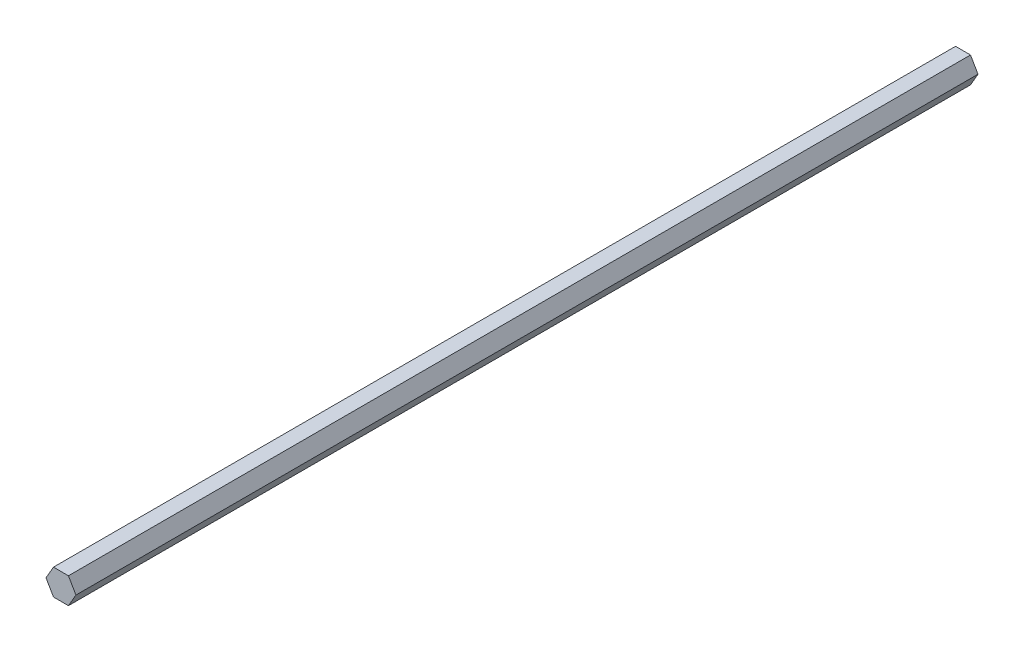
ISO-10303-21;
HEADER;
FILE_DESCRIPTION(('STEP AP214'),'2;1');
FILE_NAME('part.step','',(''),(''),'','','');
FILE_SCHEMA(('AUTOMOTIVE_DESIGN { 1 0 10303 214 1 1 1 1 }'));
ENDSEC;
DATA;
#1=APPLICATION_CONTEXT('core data for automotive mechanical design processes');
#2=APPLICATION_PROTOCOL_DEFINITION('international standard','automotive_design',2000,#1);
#3=PRODUCT_CONTEXT('',#1,'mechanical');
#4=PRODUCT('Part','Part','',(#3));
#5=PRODUCT_RELATED_PRODUCT_CATEGORY('part','',(#4));
#6=PRODUCT_DEFINITION_FORMATION('','',#4);
#7=PRODUCT_DEFINITION_CONTEXT('part definition',#1,'design');
#8=PRODUCT_DEFINITION('design','',#6,#7);
#9=PRODUCT_DEFINITION_SHAPE('','',#8);
#10=(LENGTH_UNIT() NAMED_UNIT(*) SI_UNIT(.MILLI.,.METRE.));
#11=(NAMED_UNIT(*) PLANE_ANGLE_UNIT() SI_UNIT($,.RADIAN.));
#12=(NAMED_UNIT(*) SI_UNIT($,.STERADIAN.) SOLID_ANGLE_UNIT());
#13=UNCERTAINTY_MEASURE_WITH_UNIT(LENGTH_MEASURE(1.E-05),#10,'distance_accuracy_value','');
#14=(GEOMETRIC_REPRESENTATION_CONTEXT(3) GLOBAL_UNCERTAINTY_ASSIGNED_CONTEXT((#13)) GLOBAL_UNIT_ASSIGNED_CONTEXT((#10,
#11,#12)) REPRESENTATION_CONTEXT('',''));
#15=CARTESIAN_POINT('',(0.,0.,0.));
#16=DIRECTION('',(0.,0.,1.));
#17=DIRECTION('',(1.,0.,0.));
#18=AXIS2_PLACEMENT_3D('',#15,#16,#17);
#19=CARTESIAN_POINT('',(3.66617420935412,-6.35,441.96));
#20=DIRECTION('',(-0.866025403784439,0.5,0.));
#21=DIRECTION('',(-0.5,-0.866025403784439,0.));
#22=AXIS2_PLACEMENT_3D('',#19,#20,#21);
#23=PLANE('',#22);
#24=DIRECTION('',(0.5,0.866025403784439,0.));
#25=VECTOR('',#24,1.);
#26=CARTESIAN_POINT('',(3.66617420935412,-6.35,0.));
#27=LINE('',#26,#25);
#28=CARTESIAN_POINT('',(3.66617420935412,-6.35,0.));
#29=VERTEX_POINT('',#28);
#30=CARTESIAN_POINT('',(7.33234841870825,0.,0.));
#31=VERTEX_POINT('',#30);
#32=EDGE_CURVE('E119',#29,#31,#27,.T.);
#33=ORIENTED_EDGE('',*,*,#32,.T.);
#34=DIRECTION('',(0.,0.,-1.));
#35=VECTOR('',#34,1.);
#36=CARTESIAN_POINT('',(7.33234841870825,0.,441.96));
#37=LINE('',#36,#35);
#38=CARTESIAN_POINT('',(7.33234841870825,0.,441.96));
#39=VERTEX_POINT('',#38);
#40=EDGE_CURVE('E11',#39,#31,#37,.T.);
#41=ORIENTED_EDGE('',*,*,#40,.F.);
#42=DIRECTION('',(0.5,0.866025403784439,0.));
#43=VECTOR('',#42,1.);
#44=CARTESIAN_POINT('',(3.66617420935412,-6.35,441.96));
#45=LINE('',#44,#43);
#46=CARTESIAN_POINT('',(3.66617420935412,-6.35,441.96));
#47=VERTEX_POINT('',#46);
#48=EDGE_CURVE('E129',#47,#39,#45,.T.);
#49=ORIENTED_EDGE('',*,*,#48,.F.);
#50=DIRECTION('',(0.,0.,-1.));
#51=VECTOR('',#50,1.);
#52=CARTESIAN_POINT('',(3.66617420935412,-6.35,441.96));
#53=LINE('',#52,#51);
#54=EDGE_CURVE('E115',#47,#29,#53,.T.);
#55=ORIENTED_EDGE('',*,*,#54,.T.);
#56=EDGE_LOOP('',(#33,#41,#49,#55));
#57=FACE_BOUND('',#56,.T.);
#58=ADVANCED_FACE('F35',(#57),#23,.F.);
#59=CARTESIAN_POINT('',(7.33234841870825,0.,441.96));
#60=DIRECTION('',(-0.866025403784439,-0.5,0.));
#61=DIRECTION('',(0.5,-0.866025403784439,0.));
#62=AXIS2_PLACEMENT_3D('',#59,#60,#61);
#63=PLANE('',#62);
#64=DIRECTION('',(-0.5,0.866025403784439,0.));
#65=VECTOR('',#64,1.);
#66=CARTESIAN_POINT('',(7.33234841870825,0.,0.));
#67=LINE('',#66,#65);
#68=CARTESIAN_POINT('',(3.66617420935412,6.35,0.));
#69=VERTEX_POINT('',#68);
#70=EDGE_CURVE('E122',#31,#69,#67,.T.);
#71=ORIENTED_EDGE('',*,*,#70,.T.);
#72=DIRECTION('',(0.,0.,-1.));
#73=VECTOR('',#72,1.);
#74=CARTESIAN_POINT('',(3.66617420935412,6.35,441.96));
#75=LINE('',#74,#73);
#76=CARTESIAN_POINT('',(3.66617420935412,6.35,441.96));
#77=VERTEX_POINT('',#76);
#78=EDGE_CURVE('E43',#77,#69,#75,.T.);
#79=ORIENTED_EDGE('',*,*,#78,.F.);
#80=DIRECTION('',(-0.5,0.866025403784439,0.));
#81=VECTOR('',#80,1.);
#82=CARTESIAN_POINT('',(7.33234841870825,0.,441.96));
#83=LINE('',#82,#81);
#84=EDGE_CURVE('E88',#39,#77,#83,.T.);
#85=ORIENTED_EDGE('',*,*,#84,.F.);
#86=ORIENTED_EDGE('',*,*,#40,.T.);
#87=EDGE_LOOP('',(#71,#79,#85,#86));
#88=FACE_BOUND('',#87,.T.);
#89=ADVANCED_FACE('F153',(#88),#63,.F.);
#90=CARTESIAN_POINT('',(3.66617420935412,6.35,441.96));
#91=DIRECTION('',(0.,-1.,0.));
#92=DIRECTION('',(1.,0.,0.));
#93=AXIS2_PLACEMENT_3D('',#90,#91,#92);
#94=PLANE('',#93);
#95=DIRECTION('',(-1.,0.,0.));
#96=VECTOR('',#95,1.);
#97=CARTESIAN_POINT('',(3.66617420935412,6.35,0.));
#98=LINE('',#97,#96);
#99=CARTESIAN_POINT('',(-3.66617420935413,6.35,0.));
#100=VERTEX_POINT('',#99);
#101=EDGE_CURVE('E124',#69,#100,#98,.T.);
#102=ORIENTED_EDGE('',*,*,#101,.T.);
#103=DIRECTION('',(0.,0.,-1.));
#104=VECTOR('',#103,1.);
#105=CARTESIAN_POINT('',(-3.66617420935413,6.35,441.96));
#106=LINE('',#105,#104);
#107=CARTESIAN_POINT('',(-3.66617420935413,6.35,441.96));
#108=VERTEX_POINT('',#107);
#109=EDGE_CURVE('E110',#108,#100,#106,.T.);
#110=ORIENTED_EDGE('',*,*,#109,.F.);
#111=DIRECTION('',(-1.,0.,0.));
#112=VECTOR('',#111,1.);
#113=CARTESIAN_POINT('',(3.66617420935412,6.35,441.96));
#114=LINE('',#113,#112);
#115=EDGE_CURVE('E101',#77,#108,#114,.T.);
#116=ORIENTED_EDGE('',*,*,#115,.F.);
#117=ORIENTED_EDGE('',*,*,#78,.T.);
#118=EDGE_LOOP('',(#102,#110,#116,#117));
#119=FACE_BOUND('',#118,.T.);
#120=ADVANCED_FACE('F135',(#119),#94,.F.);
#121=CARTESIAN_POINT('',(-3.66617420935413,6.35,441.96));
#122=DIRECTION('',(0.866025403784439,-0.5,0.));
#123=DIRECTION('',(0.5,0.866025403784439,0.));
#124=AXIS2_PLACEMENT_3D('',#121,#122,#123);
#125=PLANE('',#124);
#126=DIRECTION('',(-0.5,-0.866025403784439,0.));
#127=VECTOR('',#126,1.);
#128=CARTESIAN_POINT('',(-3.66617420935413,6.35,0.));
#129=LINE('',#128,#127);
#130=CARTESIAN_POINT('',(-7.33234841870825,0.,0.));
#131=VERTEX_POINT('',#130);
#132=EDGE_CURVE('E109',#100,#131,#129,.T.);
#133=ORIENTED_EDGE('',*,*,#132,.T.);
#134=DIRECTION('',(0.,0.,-1.));
#135=VECTOR('',#134,1.);
#136=CARTESIAN_POINT('',(-7.33234841870825,0.,441.96));
#137=LINE('',#136,#135);
#138=CARTESIAN_POINT('',(-7.33234841870825,0.,441.96));
#139=VERTEX_POINT('',#138);
#140=EDGE_CURVE('E106',#139,#131,#137,.T.);
#141=ORIENTED_EDGE('',*,*,#140,.F.);
#142=DIRECTION('',(-0.5,-0.866025403784439,0.));
#143=VECTOR('',#142,1.);
#144=CARTESIAN_POINT('',(-3.66617420935413,6.35,441.96));
#145=LINE('',#144,#143);
#146=EDGE_CURVE('E95',#108,#139,#145,.T.);
#147=ORIENTED_EDGE('',*,*,#146,.F.);
#148=ORIENTED_EDGE('',*,*,#109,.T.);
#149=EDGE_LOOP('',(#133,#141,#147,#148));
#150=FACE_BOUND('',#149,.T.);
#151=ADVANCED_FACE('F107',(#150),#125,.F.);
#152=CARTESIAN_POINT('',(-7.33234841870825,0.,441.96));
#153=DIRECTION('',(0.866025403784439,0.5,0.));
#154=DIRECTION('',(-0.5,0.866025403784439,0.));
#155=AXIS2_PLACEMENT_3D('',#152,#153,#154);
#156=PLANE('',#155);
#157=DIRECTION('',(0.5,-0.866025403784439,0.));
#158=VECTOR('',#157,1.);
#159=CARTESIAN_POINT('',(-7.33234841870825,0.,0.));
#160=LINE('',#159,#158);
#161=CARTESIAN_POINT('',(-3.66617420935412,-6.35,0.));
#162=VERTEX_POINT('',#161);
#163=EDGE_CURVE('E74',#131,#162,#160,.T.);
#164=ORIENTED_EDGE('',*,*,#163,.T.);
#165=DIRECTION('',(0.,0.,-1.));
#166=VECTOR('',#165,1.);
#167=CARTESIAN_POINT('',(-3.66617420935412,-6.35,441.96));
#168=LINE('',#167,#166);
#169=CARTESIAN_POINT('',(-3.66617420935412,-6.35,441.96));
#170=VERTEX_POINT('',#169);
#171=EDGE_CURVE('E111',#170,#162,#168,.T.);
#172=ORIENTED_EDGE('',*,*,#171,.F.);
#173=DIRECTION('',(0.5,-0.866025403784439,0.));
#174=VECTOR('',#173,1.);
#175=CARTESIAN_POINT('',(-7.33234841870825,0.,441.96));
#176=LINE('',#175,#174);
#177=EDGE_CURVE('E99',#139,#170,#176,.T.);
#178=ORIENTED_EDGE('',*,*,#177,.F.);
#179=ORIENTED_EDGE('',*,*,#140,.T.);
#180=EDGE_LOOP('',(#164,#172,#178,#179));
#181=FACE_BOUND('',#180,.T.);
#182=ADVANCED_FACE('F113',(#181),#156,.F.);
#183=CARTESIAN_POINT('',(-3.66617420935412,-6.35,441.96));
#184=DIRECTION('',(0.,1.,0.));
#185=DIRECTION('',(0.,0.,1.));
#186=AXIS2_PLACEMENT_3D('',#183,#184,#185);
#187=PLANE('',#186);
#188=DIRECTION('',(1.,0.,0.));
#189=VECTOR('',#188,1.);
#190=CARTESIAN_POINT('',(-3.66617420935412,-6.35,0.));
#191=LINE('',#190,#189);
#192=EDGE_CURVE('E80',#162,#29,#191,.T.);
#193=ORIENTED_EDGE('',*,*,#192,.T.);
#194=ORIENTED_EDGE('',*,*,#54,.F.);
#195=DIRECTION('',(1.,0.,0.));
#196=VECTOR('',#195,1.);
#197=CARTESIAN_POINT('',(-3.66617420935412,-6.35,441.96));
#198=LINE('',#197,#196);
#199=EDGE_CURVE('E51',#170,#47,#198,.T.);
#200=ORIENTED_EDGE('',*,*,#199,.F.);
#201=ORIENTED_EDGE('',*,*,#171,.T.);
#202=EDGE_LOOP('',(#193,#194,#200,#201));
#203=FACE_BOUND('',#202,.T.);
#204=ADVANCED_FACE('F142',(#203),#187,.F.);
#205=CARTESIAN_POINT('',(0.,0.,441.96));
#206=DIRECTION('',(0.,0.,1.));
#207=DIRECTION('',(1.,0.,0.));
#208=AXIS2_PLACEMENT_3D('',#205,#206,#207);
#209=PLANE('',#208);
#210=ORIENTED_EDGE('',*,*,#48,.T.);
#211=ORIENTED_EDGE('',*,*,#84,.T.);
#212=ORIENTED_EDGE('',*,*,#115,.T.);
#213=ORIENTED_EDGE('',*,*,#146,.T.);
#214=ORIENTED_EDGE('',*,*,#177,.T.);
#215=ORIENTED_EDGE('',*,*,#199,.T.);
#216=EDGE_LOOP('',(#210,#211,#212,#213,#214,#215));
#217=FACE_BOUND('',#216,.T.);
#218=ADVANCED_FACE('F97',(#217),#209,.T.);
#219=CARTESIAN_POINT('',(0.,0.,0.));
#220=DIRECTION('',(0.,0.,1.));
#221=DIRECTION('',(1.,0.,0.));
#222=AXIS2_PLACEMENT_3D('',#219,#220,#221);
#223=PLANE('',#222);
#224=ORIENTED_EDGE('',*,*,#32,.F.);
#225=ORIENTED_EDGE('',*,*,#192,.F.);
#226=ORIENTED_EDGE('',*,*,#163,.F.);
#227=ORIENTED_EDGE('',*,*,#132,.F.);
#228=ORIENTED_EDGE('',*,*,#101,.F.);
#229=ORIENTED_EDGE('',*,*,#70,.F.);
#230=EDGE_LOOP('',(#224,#225,#226,#227,#228,#229));
#231=FACE_BOUND('',#230,.T.);
#232=ADVANCED_FACE('F138',(#231),#223,.F.);
#233=CLOSED_SHELL('',(#58,#89,#120,#151,#182,#204,#218,#232));
#234=MANIFOLD_SOLID_BREP('B2',#233);
#235=ADVANCED_BREP_SHAPE_REPRESENTATION('',(#18,#234),#14);
#236=SHAPE_DEFINITION_REPRESENTATION(#9,#235);
ENDSEC;
END-ISO-10303-21;
